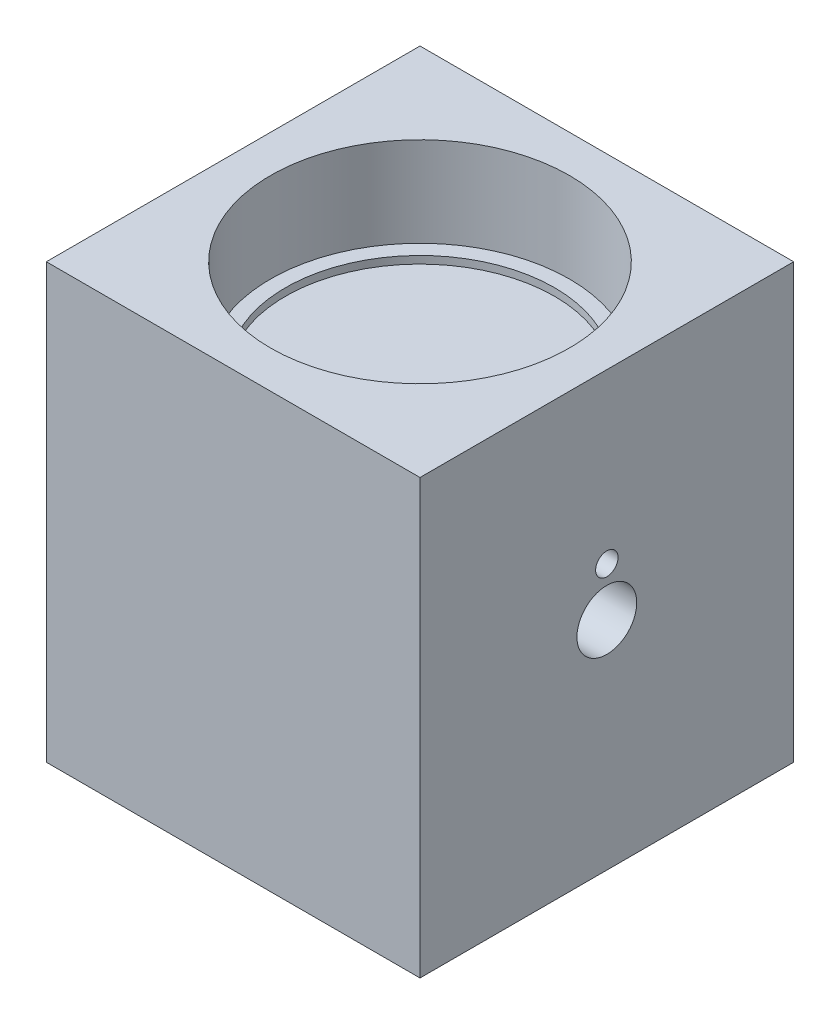
ISO-10303-21;
HEADER;
FILE_DESCRIPTION(('STEP AP214'),'2;1');
FILE_NAME('part.step','',(''),(''),'','','');
FILE_SCHEMA(('AUTOMOTIVE_DESIGN { 1 0 10303 214 1 1 1 1 }'));
ENDSEC;
DATA;
#1=APPLICATION_CONTEXT('core data for automotive mechanical design processes');
#2=APPLICATION_PROTOCOL_DEFINITION('international standard','automotive_design',2000,#1);
#3=PRODUCT_CONTEXT('',#1,'mechanical');
#4=PRODUCT('Part','Part','',(#3));
#5=PRODUCT_RELATED_PRODUCT_CATEGORY('part','',(#4));
#6=PRODUCT_DEFINITION_FORMATION('','',#4);
#7=PRODUCT_DEFINITION_CONTEXT('part definition',#1,'design');
#8=PRODUCT_DEFINITION('design','',#6,#7);
#9=PRODUCT_DEFINITION_SHAPE('','',#8);
#10=(LENGTH_UNIT() NAMED_UNIT(*) SI_UNIT(.MILLI.,.METRE.));
#11=(NAMED_UNIT(*) PLANE_ANGLE_UNIT() SI_UNIT($,.RADIAN.));
#12=(NAMED_UNIT(*) SI_UNIT($,.STERADIAN.) SOLID_ANGLE_UNIT());
#13=UNCERTAINTY_MEASURE_WITH_UNIT(LENGTH_MEASURE(1.E-05),#10,'distance_accuracy_value','');
#14=(GEOMETRIC_REPRESENTATION_CONTEXT(3) GLOBAL_UNCERTAINTY_ASSIGNED_CONTEXT((#13)) GLOBAL_UNIT_ASSIGNED_CONTEXT((#10,
#11,#12)) REPRESENTATION_CONTEXT('',''));
#15=CARTESIAN_POINT('',(0.,0.,0.));
#16=DIRECTION('',(0.,0.,1.));
#17=DIRECTION('',(1.,0.,0.));
#18=AXIS2_PLACEMENT_3D('',#15,#16,#17);
#19=CARTESIAN_POINT('',(25.,29.,25.));
#20=DIRECTION('',(-1.,0.,0.));
#21=DIRECTION('',(0.,0.,1.));
#22=AXIS2_PLACEMENT_3D('',#19,#20,#21);
#23=PLANE('',#22);
#24=CARTESIAN_POINT('',(25.,0.,0.));
#25=DIRECTION('',(-1.,0.,0.));
#26=DIRECTION('',(0.,0.,1.));
#27=AXIS2_PLACEMENT_3D('',#24,#25,#26);
#28=CIRCLE('',#27,4.);
#29=CARTESIAN_POINT('',(25.,0.,4.));
#30=VERTEX_POINT('',#29);
#31=EDGE_CURVE('E120',#30,#30,#28,.T.);
#32=ORIENTED_EDGE('',*,*,#31,.T.);
#33=EDGE_LOOP('',(#32));
#34=FACE_BOUND('',#33,.T.);
#35=CARTESIAN_POINT('',(25.,6.5,0.));
#36=DIRECTION('',(-1.,0.,0.));
#37=DIRECTION('',(0.,0.,1.));
#38=AXIS2_PLACEMENT_3D('',#35,#36,#37);
#39=CIRCLE('',#38,1.5);
#40=CARTESIAN_POINT('',(25.,6.5,1.5));
#41=VERTEX_POINT('',#40);
#42=EDGE_CURVE('E114',#41,#41,#39,.T.);
#43=ORIENTED_EDGE('',*,*,#42,.T.);
#44=EDGE_LOOP('',(#43));
#45=FACE_BOUND('',#44,.T.);
#46=DIRECTION('',(0.,0.,-1.));
#47=VECTOR('',#46,1.);
#48=CARTESIAN_POINT('',(25.,-29.,25.));
#49=LINE('',#48,#47);
#50=CARTESIAN_POINT('',(25.,-29.,25.));
#51=VERTEX_POINT('',#50);
#52=CARTESIAN_POINT('',(25.,-29.,-25.));
#53=VERTEX_POINT('',#52);
#54=EDGE_CURVE('E97',#51,#53,#49,.T.);
#55=ORIENTED_EDGE('',*,*,#54,.T.);
#56=DIRECTION('',(0.,-1.,0.));
#57=VECTOR('',#56,1.);
#58=CARTESIAN_POINT('',(25.,29.,-25.));
#59=LINE('',#58,#57);
#60=CARTESIAN_POINT('',(25.,29.,-25.));
#61=VERTEX_POINT('',#60);
#62=EDGE_CURVE('E11',#61,#53,#59,.T.);
#63=ORIENTED_EDGE('',*,*,#62,.F.);
#64=DIRECTION('',(0.,0.,-1.));
#65=VECTOR('',#64,1.);
#66=CARTESIAN_POINT('',(25.,29.,25.));
#67=LINE('',#66,#65);
#68=CARTESIAN_POINT('',(25.,29.,25.));
#69=VERTEX_POINT('',#68);
#70=EDGE_CURVE('E85',#69,#61,#67,.T.);
#71=ORIENTED_EDGE('',*,*,#70,.F.);
#72=DIRECTION('',(0.,-1.,0.));
#73=VECTOR('',#72,1.);
#74=CARTESIAN_POINT('',(25.,29.,25.));
#75=LINE('',#74,#73);
#76=EDGE_CURVE('E93',#69,#51,#75,.T.);
#77=ORIENTED_EDGE('',*,*,#76,.T.);
#78=EDGE_LOOP('',(#55,#63,#71,#77));
#79=FACE_BOUND('',#78,.T.);
#80=ADVANCED_FACE('F34',(#34,#45,#79),#23,.F.);
#81=CARTESIAN_POINT('',(-25.,29.,-25.));
#82=DIRECTION('',(0.,0.,1.));
#83=DIRECTION('',(1.,0.,0.));
#84=AXIS2_PLACEMENT_3D('',#81,#82,#83);
#85=PLANE('',#84);
#86=DIRECTION('',(-1.,0.,0.));
#87=VECTOR('',#86,1.);
#88=CARTESIAN_POINT('',(-25.,-29.,-25.));
#89=LINE('',#88,#87);
#90=CARTESIAN_POINT('',(-25.,-29.,-25.));
#91=VERTEX_POINT('',#90);
#92=EDGE_CURVE('E89',#53,#91,#89,.T.);
#93=ORIENTED_EDGE('',*,*,#92,.T.);
#94=DIRECTION('',(0.,-1.,0.));
#95=VECTOR('',#94,1.);
#96=CARTESIAN_POINT('',(-25.,29.,-25.));
#97=LINE('',#96,#95);
#98=CARTESIAN_POINT('',(-25.,29.,-25.));
#99=VERTEX_POINT('',#98);
#100=EDGE_CURVE('E42',#99,#91,#97,.T.);
#101=ORIENTED_EDGE('',*,*,#100,.F.);
#102=DIRECTION('',(-1.,0.,0.));
#103=VECTOR('',#102,1.);
#104=CARTESIAN_POINT('',(-25.,29.,-25.));
#105=LINE('',#104,#103);
#106=EDGE_CURVE('E80',#61,#99,#105,.T.);
#107=ORIENTED_EDGE('',*,*,#106,.F.);
#108=ORIENTED_EDGE('',*,*,#62,.T.);
#109=EDGE_LOOP('',(#93,#101,#107,#108));
#110=FACE_BOUND('',#109,.T.);
#111=ADVANCED_FACE('F88',(#110),#85,.F.);
#112=CARTESIAN_POINT('',(-25.,29.,25.));
#113=DIRECTION('',(1.,0.,0.));
#114=DIRECTION('',(0.,0.,-1.));
#115=AXIS2_PLACEMENT_3D('',#112,#113,#114);
#116=PLANE('',#115);
#117=CARTESIAN_POINT('',(-25.,0.,0.));
#118=DIRECTION('',(-1.,0.,0.));
#119=DIRECTION('',(0.,0.,1.));
#120=AXIS2_PLACEMENT_3D('',#117,#118,#119);
#121=CIRCLE('',#120,10.);
#122=CARTESIAN_POINT('',(-25.,0.,10.));
#123=VERTEX_POINT('',#122);
#124=EDGE_CURVE('E111',#123,#123,#121,.T.);
#125=ORIENTED_EDGE('',*,*,#124,.F.);
#126=EDGE_LOOP('',(#125));
#127=FACE_BOUND('',#126,.T.);
#128=DIRECTION('',(0.,0.,1.));
#129=VECTOR('',#128,1.);
#130=CARTESIAN_POINT('',(-25.,-29.,25.));
#131=LINE('',#130,#129);
#132=CARTESIAN_POINT('',(-25.,-29.,25.));
#133=VERTEX_POINT('',#132);
#134=EDGE_CURVE('E67',#91,#133,#131,.T.);
#135=ORIENTED_EDGE('',*,*,#134,.T.);
#136=DIRECTION('',(0.,-1.,0.));
#137=VECTOR('',#136,1.);
#138=CARTESIAN_POINT('',(-25.,29.,25.));
#139=LINE('',#138,#137);
#140=CARTESIAN_POINT('',(-25.,29.,25.));
#141=VERTEX_POINT('',#140);
#142=EDGE_CURVE('E90',#141,#133,#139,.T.);
#143=ORIENTED_EDGE('',*,*,#142,.F.);
#144=DIRECTION('',(0.,0.,1.));
#145=VECTOR('',#144,1.);
#146=CARTESIAN_POINT('',(-25.,29.,25.));
#147=LINE('',#146,#145);
#148=EDGE_CURVE('E83',#99,#141,#147,.T.);
#149=ORIENTED_EDGE('',*,*,#148,.F.);
#150=ORIENTED_EDGE('',*,*,#100,.T.);
#151=EDGE_LOOP('',(#135,#143,#149,#150));
#152=FACE_BOUND('',#151,.T.);
#153=ADVANCED_FACE('F91',(#127,#152),#116,.F.);
#154=CARTESIAN_POINT('',(-25.,29.,25.));
#155=DIRECTION('',(0.,0.,-1.));
#156=DIRECTION('',(-1.,0.,0.));
#157=AXIS2_PLACEMENT_3D('',#154,#155,#156);
#158=PLANE('',#157);
#159=DIRECTION('',(1.,0.,0.));
#160=VECTOR('',#159,1.);
#161=CARTESIAN_POINT('',(-25.,-29.,25.));
#162=LINE('',#161,#160);
#163=EDGE_CURVE('E73',#133,#51,#162,.T.);
#164=ORIENTED_EDGE('',*,*,#163,.T.);
#165=ORIENTED_EDGE('',*,*,#76,.F.);
#166=DIRECTION('',(1.,0.,0.));
#167=VECTOR('',#166,1.);
#168=CARTESIAN_POINT('',(-25.,29.,25.));
#169=LINE('',#168,#167);
#170=EDGE_CURVE('E50',#141,#69,#169,.T.);
#171=ORIENTED_EDGE('',*,*,#170,.F.);
#172=ORIENTED_EDGE('',*,*,#142,.T.);
#173=EDGE_LOOP('',(#164,#165,#171,#172));
#174=FACE_BOUND('',#173,.T.);
#175=ADVANCED_FACE('F105',(#174),#158,.F.);
#176=CARTESIAN_POINT('',(0.,29.,0.));
#177=DIRECTION('',(0.,-1.,0.));
#178=DIRECTION('',(0.,0.,-1.));
#179=AXIS2_PLACEMENT_3D('',#176,#177,#178);
#180=PLANE('',#179);
#181=CARTESIAN_POINT('',(0.,29.,0.));
#182=DIRECTION('',(0.,1.,0.));
#183=DIRECTION('',(0.,0.,1.));
#184=AXIS2_PLACEMENT_3D('',#181,#182,#183);
#185=CIRCLE('',#184,20.);
#186=CARTESIAN_POINT('',(0.,29.,20.));
#187=VERTEX_POINT('',#186);
#188=EDGE_CURVE('E129',#187,#187,#185,.T.);
#189=ORIENTED_EDGE('',*,*,#188,.F.);
#190=EDGE_LOOP('',(#189));
#191=FACE_BOUND('',#190,.T.);
#192=ORIENTED_EDGE('',*,*,#70,.T.);
#193=ORIENTED_EDGE('',*,*,#106,.T.);
#194=ORIENTED_EDGE('',*,*,#148,.T.);
#195=ORIENTED_EDGE('',*,*,#170,.T.);
#196=EDGE_LOOP('',(#192,#193,#194,#195));
#197=FACE_BOUND('',#196,.T.);
#198=ADVANCED_FACE('F81',(#191,#197),#180,.F.);
#199=CARTESIAN_POINT('',(0.,-29.,0.));
#200=DIRECTION('',(0.,-1.,0.));
#201=DIRECTION('',(0.,0.,-1.));
#202=AXIS2_PLACEMENT_3D('',#199,#200,#201);
#203=PLANE('',#202);
#204=CARTESIAN_POINT('',(0.,-29.,0.));
#205=DIRECTION('',(0.,1.,0.));
#206=DIRECTION('',(0.,0.,1.));
#207=AXIS2_PLACEMENT_3D('',#204,#205,#206);
#208=CIRCLE('',#207,20.);
#209=CARTESIAN_POINT('',(0.,-29.,20.));
#210=VERTEX_POINT('',#209);
#211=EDGE_CURVE('E141',#210,#210,#208,.T.);
#212=ORIENTED_EDGE('',*,*,#211,.T.);
#213=EDGE_LOOP('',(#212));
#214=FACE_BOUND('',#213,.T.);
#215=ORIENTED_EDGE('',*,*,#54,.F.);
#216=ORIENTED_EDGE('',*,*,#163,.F.);
#217=ORIENTED_EDGE('',*,*,#134,.F.);
#218=ORIENTED_EDGE('',*,*,#92,.F.);
#219=EDGE_LOOP('',(#215,#216,#217,#218));
#220=FACE_BOUND('',#219,.T.);
#221=ADVANCED_FACE('F108',(#214,#220),#203,.T.);
#222=CARTESIAN_POINT('',(15.,0.,0.));
#223=DIRECTION('',(-1.,0.,0.));
#224=DIRECTION('',(0.,0.,1.));
#225=AXIS2_PLACEMENT_3D('',#222,#223,#224);
#226=CYLINDRICAL_SURFACE('',#225,10.);
#227=CARTESIAN_POINT('',(15.,0.,0.));
#228=DIRECTION('',(-1.,0.,0.));
#229=DIRECTION('',(0.,0.,1.));
#230=AXIS2_PLACEMENT_3D('',#227,#228,#229);
#231=CIRCLE('',#230,10.);
#232=CARTESIAN_POINT('',(15.,0.,10.));
#233=VERTEX_POINT('',#232);
#234=EDGE_CURVE('E100',#233,#233,#231,.T.);
#235=ORIENTED_EDGE('',*,*,#234,.F.);
#236=EDGE_LOOP('',(#235));
#237=FACE_BOUND('',#236,.T.);
#238=ORIENTED_EDGE('',*,*,#124,.T.);
#239=EDGE_LOOP('',(#238));
#240=FACE_BOUND('',#239,.T.);
#241=ADVANCED_FACE('F183',(#237,#240),#226,.F.);
#242=CARTESIAN_POINT('',(15.,0.,0.));
#243=DIRECTION('',(-1.,0.,0.));
#244=DIRECTION('',(0.,0.,1.));
#245=AXIS2_PLACEMENT_3D('',#242,#243,#244);
#246=PLANE('',#245);
#247=CARTESIAN_POINT('',(15.,0.,0.));
#248=DIRECTION('',(-1.,0.,0.));
#249=DIRECTION('',(0.,0.,1.));
#250=AXIS2_PLACEMENT_3D('',#247,#248,#249);
#251=CIRCLE('',#250,4.);
#252=CARTESIAN_POINT('',(15.,0.,4.));
#253=VERTEX_POINT('',#252);
#254=EDGE_CURVE('E123',#253,#253,#251,.T.);
#255=ORIENTED_EDGE('',*,*,#254,.F.);
#256=EDGE_LOOP('',(#255));
#257=FACE_BOUND('',#256,.T.);
#258=CARTESIAN_POINT('',(15.,6.5,0.));
#259=DIRECTION('',(-1.,0.,0.));
#260=DIRECTION('',(0.,0.,1.));
#261=AXIS2_PLACEMENT_3D('',#258,#259,#260);
#262=CIRCLE('',#261,1.5);
#263=CARTESIAN_POINT('',(15.,6.5,1.5));
#264=VERTEX_POINT('',#263);
#265=EDGE_CURVE('E117',#264,#264,#262,.T.);
#266=ORIENTED_EDGE('',*,*,#265,.F.);
#267=EDGE_LOOP('',(#266));
#268=FACE_BOUND('',#267,.T.);
#269=ORIENTED_EDGE('',*,*,#234,.T.);
#270=EDGE_LOOP('',(#269));
#271=FACE_BOUND('',#270,.T.);
#272=ADVANCED_FACE('F177',(#257,#268,#271),#246,.T.);
#273=CARTESIAN_POINT('',(25.,6.5,0.));
#274=DIRECTION('',(-1.,0.,0.));
#275=DIRECTION('',(0.,0.,1.));
#276=AXIS2_PLACEMENT_3D('',#273,#274,#275);
#277=CYLINDRICAL_SURFACE('',#276,1.5);
#278=ORIENTED_EDGE('',*,*,#42,.F.);
#279=EDGE_LOOP('',(#278));
#280=FACE_BOUND('',#279,.T.);
#281=ORIENTED_EDGE('',*,*,#265,.T.);
#282=EDGE_LOOP('',(#281));
#283=FACE_BOUND('',#282,.T.);
#284=ADVANCED_FACE('F173',(#280,#283),#277,.F.);
#285=CARTESIAN_POINT('',(25.,0.,0.));
#286=DIRECTION('',(-1.,0.,0.));
#287=DIRECTION('',(0.,0.,1.));
#288=AXIS2_PLACEMENT_3D('',#285,#286,#287);
#289=CYLINDRICAL_SURFACE('',#288,4.);
#290=ORIENTED_EDGE('',*,*,#31,.F.);
#291=EDGE_LOOP('',(#290));
#292=FACE_BOUND('',#291,.T.);
#293=ORIENTED_EDGE('',*,*,#254,.T.);
#294=EDGE_LOOP('',(#293));
#295=FACE_BOUND('',#294,.T.);
#296=ADVANCED_FACE('F176',(#292,#295),#289,.F.);
#297=CARTESIAN_POINT('',(0.,17.,0.));
#298=DIRECTION('',(0.,1.,0.));
#299=DIRECTION('',(0.,0.,1.));
#300=AXIS2_PLACEMENT_3D('',#297,#298,#299);
#301=CYLINDRICAL_SURFACE('',#300,20.);
#302=CARTESIAN_POINT('',(0.,17.,0.));
#303=DIRECTION('',(0.,1.,0.));
#304=DIRECTION('',(0.,0.,1.));
#305=AXIS2_PLACEMENT_3D('',#302,#303,#304);
#306=CIRCLE('',#305,20.);
#307=CARTESIAN_POINT('',(0.,17.,20.));
#308=VERTEX_POINT('',#307);
#309=EDGE_CURVE('E126',#308,#308,#306,.T.);
#310=ORIENTED_EDGE('',*,*,#309,.F.);
#311=EDGE_LOOP('',(#310));
#312=FACE_BOUND('',#311,.T.);
#313=ORIENTED_EDGE('',*,*,#188,.T.);
#314=EDGE_LOOP('',(#313));
#315=FACE_BOUND('',#314,.T.);
#316=ADVANCED_FACE('F208',(#312,#315),#301,.F.);
#317=CARTESIAN_POINT('',(0.,17.,0.));
#318=DIRECTION('',(0.,1.,0.));
#319=DIRECTION('',(0.,0.,1.));
#320=AXIS2_PLACEMENT_3D('',#317,#318,#319);
#321=PLANE('',#320);
#322=CARTESIAN_POINT('',(0.,17.,0.));
#323=DIRECTION('',(0.,1.,0.));
#324=DIRECTION('',(0.,0.,1.));
#325=AXIS2_PLACEMENT_3D('',#322,#323,#324);
#326=CIRCLE('',#325,18.);
#327=CARTESIAN_POINT('',(0.,17.,18.));
#328=VERTEX_POINT('',#327);
#329=EDGE_CURVE('E135',#328,#328,#326,.T.);
#330=ORIENTED_EDGE('',*,*,#329,.F.);
#331=EDGE_LOOP('',(#330));
#332=FACE_BOUND('',#331,.T.);
#333=ORIENTED_EDGE('',*,*,#309,.T.);
#334=EDGE_LOOP('',(#333));
#335=FACE_BOUND('',#334,.T.);
#336=ADVANCED_FACE('F212',(#332,#335),#321,.T.);
#337=CARTESIAN_POINT('',(0.,16.,0.));
#338=DIRECTION('',(0.,1.,0.));
#339=DIRECTION('',(0.,0.,1.));
#340=AXIS2_PLACEMENT_3D('',#337,#338,#339);
#341=CYLINDRICAL_SURFACE('',#340,18.);
#342=CARTESIAN_POINT('',(0.,16.,0.));
#343=DIRECTION('',(0.,1.,0.));
#344=DIRECTION('',(0.,0.,1.));
#345=AXIS2_PLACEMENT_3D('',#342,#343,#344);
#346=CIRCLE('',#345,18.);
#347=CARTESIAN_POINT('',(0.,16.,18.));
#348=VERTEX_POINT('',#347);
#349=EDGE_CURVE('E132',#348,#348,#346,.T.);
#350=ORIENTED_EDGE('',*,*,#349,.F.);
#351=EDGE_LOOP('',(#350));
#352=FACE_BOUND('',#351,.T.);
#353=ORIENTED_EDGE('',*,*,#329,.T.);
#354=EDGE_LOOP('',(#353));
#355=FACE_BOUND('',#354,.T.);
#356=ADVANCED_FACE('F216',(#352,#355),#341,.F.);
#357=CARTESIAN_POINT('',(0.,16.,0.));
#358=DIRECTION('',(0.,1.,0.));
#359=DIRECTION('',(0.,0.,1.));
#360=AXIS2_PLACEMENT_3D('',#357,#358,#359);
#361=PLANE('',#360);
#362=ORIENTED_EDGE('',*,*,#349,.T.);
#363=EDGE_LOOP('',(#362));
#364=FACE_BOUND('',#363,.T.);
#365=ADVANCED_FACE('F220',(#364),#361,.T.);
#366=CARTESIAN_POINT('',(0.,-17.,0.));
#367=DIRECTION('',(0.,-1.,0.));
#368=DIRECTION('',(0.,0.,-1.));
#369=AXIS2_PLACEMENT_3D('',#366,#367,#368);
#370=CYLINDRICAL_SURFACE('',#369,20.);
#371=CARTESIAN_POINT('',(0.,-17.,0.));
#372=DIRECTION('',(0.,1.,0.));
#373=DIRECTION('',(0.,0.,1.));
#374=AXIS2_PLACEMENT_3D('',#371,#372,#373);
#375=CIRCLE('',#374,20.);
#376=CARTESIAN_POINT('',(0.,-17.,20.));
#377=VERTEX_POINT('',#376);
#378=EDGE_CURVE('E138',#377,#377,#375,.T.);
#379=ORIENTED_EDGE('',*,*,#378,.T.);
#380=EDGE_LOOP('',(#379));
#381=FACE_BOUND('',#380,.T.);
#382=ORIENTED_EDGE('',*,*,#211,.F.);
#383=EDGE_LOOP('',(#382));
#384=FACE_BOUND('',#383,.T.);
#385=ADVANCED_FACE('F224',(#381,#384),#370,.F.);
#386=CARTESIAN_POINT('',(0.,-17.,0.));
#387=DIRECTION('',(0.,-1.,0.));
#388=DIRECTION('',(0.,0.,1.));
#389=AXIS2_PLACEMENT_3D('',#386,#387,#388);
#390=PLANE('',#389);
#391=CARTESIAN_POINT('',(0.,-17.,0.));
#392=DIRECTION('',(0.,1.,0.));
#393=DIRECTION('',(0.,0.,1.));
#394=AXIS2_PLACEMENT_3D('',#391,#392,#393);
#395=CIRCLE('',#394,18.);
#396=CARTESIAN_POINT('',(0.,-17.,18.));
#397=VERTEX_POINT('',#396);
#398=EDGE_CURVE('E147',#397,#397,#395,.T.);
#399=ORIENTED_EDGE('',*,*,#398,.T.);
#400=EDGE_LOOP('',(#399));
#401=FACE_BOUND('',#400,.T.);
#402=ORIENTED_EDGE('',*,*,#378,.F.);
#403=EDGE_LOOP('',(#402));
#404=FACE_BOUND('',#403,.T.);
#405=ADVANCED_FACE('F162',(#401,#404),#390,.T.);
#406=CARTESIAN_POINT('',(0.,-16.,0.));
#407=DIRECTION('',(0.,-1.,0.));
#408=DIRECTION('',(0.,0.,-1.));
#409=AXIS2_PLACEMENT_3D('',#406,#407,#408);
#410=CYLINDRICAL_SURFACE('',#409,18.);
#411=CARTESIAN_POINT('',(0.,-16.,0.));
#412=DIRECTION('',(0.,1.,0.));
#413=DIRECTION('',(0.,0.,1.));
#414=AXIS2_PLACEMENT_3D('',#411,#412,#413);
#415=CIRCLE('',#414,18.);
#416=CARTESIAN_POINT('',(0.,-16.,18.));
#417=VERTEX_POINT('',#416);
#418=EDGE_CURVE('E144',#417,#417,#415,.T.);
#419=ORIENTED_EDGE('',*,*,#418,.T.);
#420=EDGE_LOOP('',(#419));
#421=FACE_BOUND('',#420,.T.);
#422=ORIENTED_EDGE('',*,*,#398,.F.);
#423=EDGE_LOOP('',(#422));
#424=FACE_BOUND('',#423,.T.);
#425=ADVANCED_FACE('F153',(#421,#424),#410,.F.);
#426=CARTESIAN_POINT('',(0.,-16.,0.));
#427=DIRECTION('',(0.,-1.,0.));
#428=DIRECTION('',(0.,0.,1.));
#429=AXIS2_PLACEMENT_3D('',#426,#427,#428);
#430=PLANE('',#429);
#431=ORIENTED_EDGE('',*,*,#418,.F.);
#432=EDGE_LOOP('',(#431));
#433=FACE_BOUND('',#432,.T.);
#434=ADVANCED_FACE('F156',(#433),#430,.T.);
#435=CLOSED_SHELL('',(#80,#111,#153,#175,#198,#221,#241,#272,#284,#296,#316,#336,#356,#365,#385,
#405,#425,#434));
#436=MANIFOLD_SOLID_BREP('B2',#435);
#437=ADVANCED_BREP_SHAPE_REPRESENTATION('',(#18,#436),#14);
#438=SHAPE_DEFINITION_REPRESENTATION(#9,#437);
ENDSEC;
END-ISO-10303-21;
